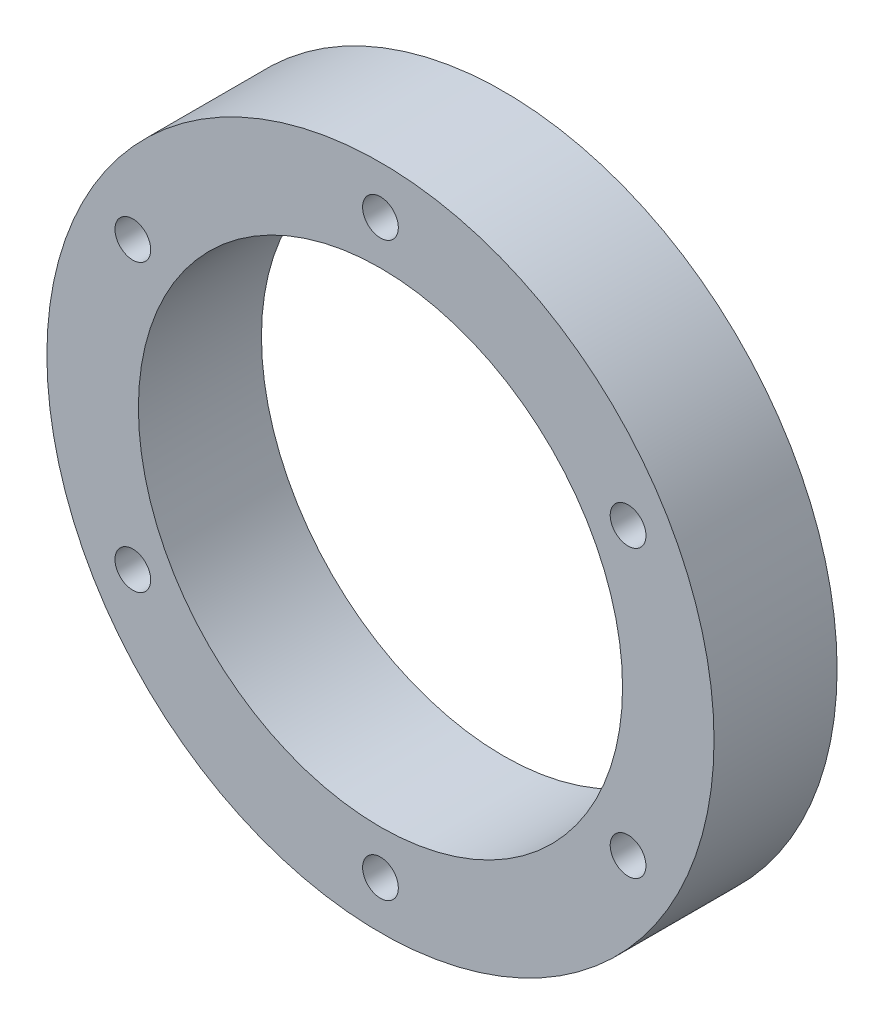
ISO-10303-21;
HEADER;
FILE_DESCRIPTION(('STEP AP214'),'2;1');
FILE_NAME('part.step','',(''),(''),'','','');
FILE_SCHEMA(('AUTOMOTIVE_DESIGN { 1 0 10303 214 1 1 1 1 }'));
ENDSEC;
DATA;
#1=APPLICATION_CONTEXT('core data for automotive mechanical design processes');
#2=APPLICATION_PROTOCOL_DEFINITION('international standard','automotive_design',2000,#1);
#3=PRODUCT_CONTEXT('',#1,'mechanical');
#4=PRODUCT('Part','Part','',(#3));
#5=PRODUCT_RELATED_PRODUCT_CATEGORY('part','',(#4));
#6=PRODUCT_DEFINITION_FORMATION('','',#4);
#7=PRODUCT_DEFINITION_CONTEXT('part definition',#1,'design');
#8=PRODUCT_DEFINITION('design','',#6,#7);
#9=PRODUCT_DEFINITION_SHAPE('','',#8);
#10=(LENGTH_UNIT() NAMED_UNIT(*) SI_UNIT(.MILLI.,.METRE.));
#11=(NAMED_UNIT(*) PLANE_ANGLE_UNIT() SI_UNIT($,.RADIAN.));
#12=(NAMED_UNIT(*) SI_UNIT($,.STERADIAN.) SOLID_ANGLE_UNIT());
#13=UNCERTAINTY_MEASURE_WITH_UNIT(LENGTH_MEASURE(1.E-05),#10,'distance_accuracy_value','');
#14=(GEOMETRIC_REPRESENTATION_CONTEXT(3) GLOBAL_UNCERTAINTY_ASSIGNED_CONTEXT((#13)) GLOBAL_UNIT_ASSIGNED_CONTEXT((#10,
#11,#12)) REPRESENTATION_CONTEXT('',''));
#15=CARTESIAN_POINT('',(0.,0.,0.));
#16=DIRECTION('',(0.,0.,1.));
#17=DIRECTION('',(1.,0.,0.));
#18=AXIS2_PLACEMENT_3D('',#15,#16,#17);
#19=CARTESIAN_POINT('',(0.,0.,8.2));
#20=DIRECTION('',(0.,0.,1.));
#21=DIRECTION('',(1.,0.,0.));
#22=AXIS2_PLACEMENT_3D('',#19,#20,#21);
#23=PLANE('',#22);
#24=CARTESIAN_POINT('',(16.4977839420934,9.52500000000026,8.2));
#25=DIRECTION('',(0.,0.,1.));
#26=DIRECTION('',(1.,0.,0.));
#27=AXIS2_PLACEMENT_3D('',#24,#25,#26);
#28=CIRCLE('',#27,1.190625);
#29=CARTESIAN_POINT('',(17.6884089420934,9.52500000000026,8.2));
#30=VERTEX_POINT('',#29);
#31=EDGE_CURVE('E108',#30,#30,#28,.T.);
#32=ORIENTED_EDGE('',*,*,#31,.F.);
#33=EDGE_LOOP('',(#32));
#34=FACE_BOUND('',#33,.T.);
#35=CARTESIAN_POINT('',(16.4977839420937,-9.52499999999979,8.2));
#36=DIRECTION('',(0.,0.,1.));
#37=DIRECTION('',(1.,0.,0.));
#38=AXIS2_PLACEMENT_3D('',#35,#36,#37);
#39=CIRCLE('',#38,1.190625);
#40=CARTESIAN_POINT('',(17.6884089420937,-9.52499999999979,8.2));
#41=VERTEX_POINT('',#40);
#42=EDGE_CURVE('E112',#41,#41,#39,.T.);
#43=ORIENTED_EDGE('',*,*,#42,.F.);
#44=EDGE_LOOP('',(#43));
#45=FACE_BOUND('',#44,.T.);
#46=CARTESIAN_POINT('',(0.,-19.05,8.2));
#47=DIRECTION('',(0.,0.,1.));
#48=DIRECTION('',(1.,0.,0.));
#49=AXIS2_PLACEMENT_3D('',#46,#47,#48);
#50=CIRCLE('',#49,1.190625);
#51=CARTESIAN_POINT('',(1.19062500000007,-19.05,8.2));
#52=VERTEX_POINT('',#51);
#53=EDGE_CURVE('E118',#52,#52,#50,.T.);
#54=ORIENTED_EDGE('',*,*,#53,.F.);
#55=EDGE_LOOP('',(#54));
#56=FACE_BOUND('',#55,.T.);
#57=CARTESIAN_POINT('',(-16.4977839420935,-9.52500000000014,8.2));
#58=DIRECTION('',(0.,0.,1.));
#59=DIRECTION('',(1.,0.,0.));
#60=AXIS2_PLACEMENT_3D('',#57,#58,#59);
#61=CIRCLE('',#60,1.190625);
#62=CARTESIAN_POINT('',(-15.3071589420935,-9.52500000000014,8.2));
#63=VERTEX_POINT('',#62);
#64=EDGE_CURVE('E124',#63,#63,#61,.T.);
#65=ORIENTED_EDGE('',*,*,#64,.F.);
#66=EDGE_LOOP('',(#65));
#67=FACE_BOUND('',#66,.T.);
#68=CARTESIAN_POINT('',(-16.4977839420936,9.5249999999999,8.2));
#69=DIRECTION('',(0.,0.,1.));
#70=DIRECTION('',(1.,0.,0.));
#71=AXIS2_PLACEMENT_3D('',#68,#69,#70);
#72=CIRCLE('',#71,1.190625);
#73=CARTESIAN_POINT('',(-15.3071589420936,9.5249999999999,8.2));
#74=VERTEX_POINT('',#73);
#75=EDGE_CURVE('E60',#74,#74,#72,.T.);
#76=ORIENTED_EDGE('',*,*,#75,.F.);
#77=EDGE_LOOP('',(#76));
#78=FACE_BOUND('',#77,.T.);
#79=CARTESIAN_POINT('',(0.,19.05,8.2));
#80=DIRECTION('',(0.,0.,1.));
#81=DIRECTION('',(1.,0.,0.));
#82=AXIS2_PLACEMENT_3D('',#79,#80,#81);
#83=CIRCLE('',#82,1.190625);
#84=CARTESIAN_POINT('',(1.19062499999992,19.05,8.2));
#85=VERTEX_POINT('',#84);
#86=EDGE_CURVE('E50',#85,#85,#83,.T.);
#87=ORIENTED_EDGE('',*,*,#86,.F.);
#88=EDGE_LOOP('',(#87));
#89=FACE_BOUND('',#88,.T.);
#90=CARTESIAN_POINT('',(0.,0.,8.2));
#91=DIRECTION('',(0.,0.,1.));
#92=DIRECTION('',(1.,0.,0.));
#93=AXIS2_PLACEMENT_3D('',#90,#91,#92);
#94=CIRCLE('',#93,22.225);
#95=CARTESIAN_POINT('',(22.225,0.,8.2));
#96=VERTEX_POINT('',#95);
#97=EDGE_CURVE('E10',#96,#96,#94,.T.);
#98=ORIENTED_EDGE('',*,*,#97,.T.);
#99=EDGE_LOOP('',(#98));
#100=FACE_BOUND('',#99,.T.);
#101=CARTESIAN_POINT('',(0.,0.,8.2));
#102=DIRECTION('',(0.,0.,1.));
#103=DIRECTION('',(1.,0.,0.));
#104=AXIS2_PLACEMENT_3D('',#101,#102,#103);
#105=CIRCLE('',#104,16.129);
#106=CARTESIAN_POINT('',(16.129,0.,8.2));
#107=VERTEX_POINT('',#106);
#108=EDGE_CURVE('E43',#107,#107,#105,.T.);
#109=ORIENTED_EDGE('',*,*,#108,.F.);
#110=EDGE_LOOP('',(#109));
#111=FACE_BOUND('',#110,.T.);
#112=ADVANCED_FACE('F30',(#34,#45,#56,#67,#78,#89,#100,#111),#23,.T.);
#113=CARTESIAN_POINT('',(0.,0.,0.));
#114=DIRECTION('',(0.,0.,1.));
#115=DIRECTION('',(1.,0.,0.));
#116=AXIS2_PLACEMENT_3D('',#113,#114,#115);
#117=PLANE('',#116);
#118=CARTESIAN_POINT('',(16.4977839420934,9.52500000000026,0.));
#119=DIRECTION('',(0.,0.,1.));
#120=DIRECTION('',(1.,0.,0.));
#121=AXIS2_PLACEMENT_3D('',#118,#119,#120);
#122=CIRCLE('',#121,1.190625);
#123=CARTESIAN_POINT('',(17.6884089420934,9.52500000000026,0.));
#124=VERTEX_POINT('',#123);
#125=EDGE_CURVE('E111',#124,#124,#122,.T.);
#126=ORIENTED_EDGE('',*,*,#125,.T.);
#127=EDGE_LOOP('',(#126));
#128=FACE_BOUND('',#127,.T.);
#129=CARTESIAN_POINT('',(16.4977839420937,-9.52499999999979,0.));
#130=DIRECTION('',(0.,0.,1.));
#131=DIRECTION('',(1.,0.,0.));
#132=AXIS2_PLACEMENT_3D('',#129,#130,#131);
#133=CIRCLE('',#132,1.190625);
#134=CARTESIAN_POINT('',(17.6884089420937,-9.52499999999979,0.));
#135=VERTEX_POINT('',#134);
#136=EDGE_CURVE('E34',#135,#135,#133,.T.);
#137=ORIENTED_EDGE('',*,*,#136,.T.);
#138=EDGE_LOOP('',(#137));
#139=FACE_BOUND('',#138,.T.);
#140=CARTESIAN_POINT('',(0.,-19.05,0.));
#141=DIRECTION('',(0.,0.,1.));
#142=DIRECTION('',(1.,0.,0.));
#143=AXIS2_PLACEMENT_3D('',#140,#141,#142);
#144=CIRCLE('',#143,1.190625);
#145=CARTESIAN_POINT('',(1.19062500000007,-19.05,0.));
#146=VERTEX_POINT('',#145);
#147=EDGE_CURVE('E121',#146,#146,#144,.T.);
#148=ORIENTED_EDGE('',*,*,#147,.T.);
#149=EDGE_LOOP('',(#148));
#150=FACE_BOUND('',#149,.T.);
#151=CARTESIAN_POINT('',(-16.4977839420935,-9.52500000000014,0.));
#152=DIRECTION('',(0.,0.,1.));
#153=DIRECTION('',(1.,0.,0.));
#154=AXIS2_PLACEMENT_3D('',#151,#152,#153);
#155=CIRCLE('',#154,1.190625);
#156=CARTESIAN_POINT('',(-15.3071589420935,-9.52500000000014,0.));
#157=VERTEX_POINT('',#156);
#158=EDGE_CURVE('E127',#157,#157,#155,.T.);
#159=ORIENTED_EDGE('',*,*,#158,.T.);
#160=EDGE_LOOP('',(#159));
#161=FACE_BOUND('',#160,.T.);
#162=CARTESIAN_POINT('',(-16.4977839420936,9.5249999999999,0.));
#163=DIRECTION('',(0.,0.,1.));
#164=DIRECTION('',(1.,0.,0.));
#165=AXIS2_PLACEMENT_3D('',#162,#163,#164);
#166=CIRCLE('',#165,1.190625);
#167=CARTESIAN_POINT('',(-15.3071589420936,9.5249999999999,0.));
#168=VERTEX_POINT('',#167);
#169=EDGE_CURVE('E55',#168,#168,#166,.T.);
#170=ORIENTED_EDGE('',*,*,#169,.T.);
#171=EDGE_LOOP('',(#170));
#172=FACE_BOUND('',#171,.T.);
#173=CARTESIAN_POINT('',(0.,19.05,0.));
#174=DIRECTION('',(0.,0.,1.));
#175=DIRECTION('',(1.,0.,0.));
#176=AXIS2_PLACEMENT_3D('',#173,#174,#175);
#177=CIRCLE('',#176,1.190625);
#178=CARTESIAN_POINT('',(1.19062499999992,19.05,0.));
#179=VERTEX_POINT('',#178);
#180=EDGE_CURVE('E48',#179,#179,#177,.T.);
#181=ORIENTED_EDGE('',*,*,#180,.T.);
#182=EDGE_LOOP('',(#181));
#183=FACE_BOUND('',#182,.T.);
#184=CARTESIAN_POINT('',(0.,0.,0.));
#185=DIRECTION('',(0.,0.,1.));
#186=DIRECTION('',(1.,0.,0.));
#187=AXIS2_PLACEMENT_3D('',#184,#185,#186);
#188=CIRCLE('',#187,22.225);
#189=CARTESIAN_POINT('',(22.225,0.,0.));
#190=VERTEX_POINT('',#189);
#191=EDGE_CURVE('E38',#190,#190,#188,.T.);
#192=ORIENTED_EDGE('',*,*,#191,.F.);
#193=EDGE_LOOP('',(#192));
#194=FACE_BOUND('',#193,.T.);
#195=CARTESIAN_POINT('',(0.,0.,0.));
#196=DIRECTION('',(0.,0.,1.));
#197=DIRECTION('',(1.,0.,0.));
#198=AXIS2_PLACEMENT_3D('',#195,#196,#197);
#199=CIRCLE('',#198,16.129);
#200=CARTESIAN_POINT('',(16.129,0.,0.));
#201=VERTEX_POINT('',#200);
#202=EDGE_CURVE('E46',#201,#201,#199,.T.);
#203=ORIENTED_EDGE('',*,*,#202,.T.);
#204=EDGE_LOOP('',(#203));
#205=FACE_BOUND('',#204,.T.);
#206=ADVANCED_FACE('F70',(#128,#139,#150,#161,#172,#183,#194,#205),#117,.F.);
#207=CARTESIAN_POINT('',(0.,0.,8.2));
#208=DIRECTION('',(0.,0.,-1.));
#209=DIRECTION('',(-1.,0.,0.));
#210=AXIS2_PLACEMENT_3D('',#207,#208,#209);
#211=CYLINDRICAL_SURFACE('',#210,22.225);
#212=ORIENTED_EDGE('',*,*,#97,.F.);
#213=EDGE_LOOP('',(#212));
#214=FACE_BOUND('',#213,.T.);
#215=ORIENTED_EDGE('',*,*,#191,.T.);
#216=EDGE_LOOP('',(#215));
#217=FACE_BOUND('',#216,.T.);
#218=ADVANCED_FACE('F32',(#214,#217),#211,.T.);
#219=CARTESIAN_POINT('',(0.,0.,8.2));
#220=DIRECTION('',(0.,0.,-1.));
#221=DIRECTION('',(-1.,0.,0.));
#222=AXIS2_PLACEMENT_3D('',#219,#220,#221);
#223=CYLINDRICAL_SURFACE('',#222,16.129);
#224=ORIENTED_EDGE('',*,*,#108,.T.);
#225=EDGE_LOOP('',(#224));
#226=FACE_BOUND('',#225,.T.);
#227=ORIENTED_EDGE('',*,*,#202,.F.);
#228=EDGE_LOOP('',(#227));
#229=FACE_BOUND('',#228,.T.);
#230=ADVANCED_FACE('F66',(#226,#229),#223,.F.);
#231=CARTESIAN_POINT('',(0.,19.05,8.2));
#232=DIRECTION('',(0.,0.,1.));
#233=DIRECTION('',(1.,0.,0.));
#234=AXIS2_PLACEMENT_3D('',#231,#232,#233);
#235=CYLINDRICAL_SURFACE('',#234,1.190625);
#236=ORIENTED_EDGE('',*,*,#86,.T.);
#237=EDGE_LOOP('',(#236));
#238=FACE_BOUND('',#237,.T.);
#239=ORIENTED_EDGE('',*,*,#180,.F.);
#240=EDGE_LOOP('',(#239));
#241=FACE_BOUND('',#240,.T.);
#242=ADVANCED_FACE('F82',(#238,#241),#235,.F.);
#243=CARTESIAN_POINT('',(-16.4977839420936,9.5249999999999,8.2));
#244=DIRECTION('',(0.,0.,1.));
#245=DIRECTION('',(1.,0.,0.));
#246=AXIS2_PLACEMENT_3D('',#243,#244,#245);
#247=CYLINDRICAL_SURFACE('',#246,1.190625);
#248=ORIENTED_EDGE('',*,*,#75,.T.);
#249=EDGE_LOOP('',(#248));
#250=FACE_BOUND('',#249,.T.);
#251=ORIENTED_EDGE('',*,*,#169,.F.);
#252=EDGE_LOOP('',(#251));
#253=FACE_BOUND('',#252,.T.);
#254=ADVANCED_FACE('F85',(#250,#253),#247,.F.);
#255=CARTESIAN_POINT('',(-16.4977839420935,-9.52500000000014,8.2));
#256=DIRECTION('',(0.,0.,1.));
#257=DIRECTION('',(1.,0.,0.));
#258=AXIS2_PLACEMENT_3D('',#255,#256,#257);
#259=CYLINDRICAL_SURFACE('',#258,1.190625);
#260=ORIENTED_EDGE('',*,*,#64,.T.);
#261=EDGE_LOOP('',(#260));
#262=FACE_BOUND('',#261,.T.);
#263=ORIENTED_EDGE('',*,*,#158,.F.);
#264=EDGE_LOOP('',(#263));
#265=FACE_BOUND('',#264,.T.);
#266=ADVANCED_FACE('F88',(#262,#265),#259,.F.);
#267=CARTESIAN_POINT('',(0.,-19.05,8.2));
#268=DIRECTION('',(0.,0.,1.));
#269=DIRECTION('',(1.,0.,0.));
#270=AXIS2_PLACEMENT_3D('',#267,#268,#269);
#271=CYLINDRICAL_SURFACE('',#270,1.190625);
#272=ORIENTED_EDGE('',*,*,#53,.T.);
#273=EDGE_LOOP('',(#272));
#274=FACE_BOUND('',#273,.T.);
#275=ORIENTED_EDGE('',*,*,#147,.F.);
#276=EDGE_LOOP('',(#275));
#277=FACE_BOUND('',#276,.T.);
#278=ADVANCED_FACE('F92',(#274,#277),#271,.F.);
#279=CARTESIAN_POINT('',(16.4977839420937,-9.52499999999979,8.2));
#280=DIRECTION('',(0.,0.,1.));
#281=DIRECTION('',(1.,0.,0.));
#282=AXIS2_PLACEMENT_3D('',#279,#280,#281);
#283=CYLINDRICAL_SURFACE('',#282,1.190625);
#284=ORIENTED_EDGE('',*,*,#42,.T.);
#285=EDGE_LOOP('',(#284));
#286=FACE_BOUND('',#285,.T.);
#287=ORIENTED_EDGE('',*,*,#136,.F.);
#288=EDGE_LOOP('',(#287));
#289=FACE_BOUND('',#288,.T.);
#290=ADVANCED_FACE('F96',(#286,#289),#283,.F.);
#291=CARTESIAN_POINT('',(16.4977839420934,9.52500000000026,8.2));
#292=DIRECTION('',(0.,0.,1.));
#293=DIRECTION('',(1.,0.,0.));
#294=AXIS2_PLACEMENT_3D('',#291,#292,#293);
#295=CYLINDRICAL_SURFACE('',#294,1.190625);
#296=ORIENTED_EDGE('',*,*,#31,.T.);
#297=EDGE_LOOP('',(#296));
#298=FACE_BOUND('',#297,.T.);
#299=ORIENTED_EDGE('',*,*,#125,.F.);
#300=EDGE_LOOP('',(#299));
#301=FACE_BOUND('',#300,.T.);
#302=ADVANCED_FACE('F100',(#298,#301),#295,.F.);
#303=CLOSED_SHELL('',(#112,#206,#218,#230,#242,#254,#266,#278,#290,#302));
#304=MANIFOLD_SOLID_BREP('B2',#303);
#305=ADVANCED_BREP_SHAPE_REPRESENTATION('',(#18,#304),#14);
#306=SHAPE_DEFINITION_REPRESENTATION(#9,#305);
ENDSEC;
END-ISO-10303-21;
